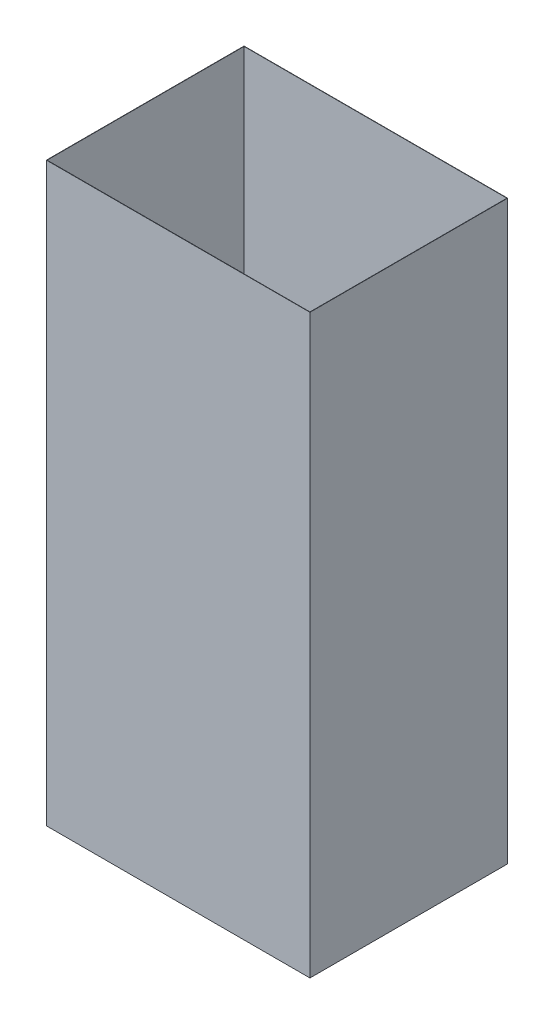
ISO-10303-21;
HEADER;
FILE_DESCRIPTION(('STEP AP214'),'2;1');
FILE_NAME('part.step','',(''),(''),'','','');
FILE_SCHEMA(('AUTOMOTIVE_DESIGN { 1 0 10303 214 1 1 1 1 }'));
ENDSEC;
DATA;
#1=APPLICATION_CONTEXT('core data for automotive mechanical design processes');
#2=APPLICATION_PROTOCOL_DEFINITION('international standard','automotive_design',2000,#1);
#3=PRODUCT_CONTEXT('',#1,'mechanical');
#4=PRODUCT('Part','Part','',(#3));
#5=PRODUCT_RELATED_PRODUCT_CATEGORY('part','',(#4));
#6=PRODUCT_DEFINITION_FORMATION('','',#4);
#7=PRODUCT_DEFINITION_CONTEXT('part definition',#1,'design');
#8=PRODUCT_DEFINITION('design','',#6,#7);
#9=PRODUCT_DEFINITION_SHAPE('','',#8);
#10=(LENGTH_UNIT() NAMED_UNIT(*) SI_UNIT(.MILLI.,.METRE.));
#11=(NAMED_UNIT(*) PLANE_ANGLE_UNIT() SI_UNIT($,.RADIAN.));
#12=(NAMED_UNIT(*) SI_UNIT($,.STERADIAN.) SOLID_ANGLE_UNIT());
#13=UNCERTAINTY_MEASURE_WITH_UNIT(LENGTH_MEASURE(1.E-05),#10,'distance_accuracy_value','');
#14=(GEOMETRIC_REPRESENTATION_CONTEXT(3) GLOBAL_UNCERTAINTY_ASSIGNED_CONTEXT((#13)) GLOBAL_UNIT_ASSIGNED_CONTEXT((#10,
#11,#12)) REPRESENTATION_CONTEXT('',''));
#15=CARTESIAN_POINT('',(0.,0.,0.));
#16=DIRECTION('',(0.,0.,1.));
#17=DIRECTION('',(1.,0.,0.));
#18=AXIS2_PLACEMENT_3D('',#15,#16,#17);
#19=CARTESIAN_POINT('',(203.2,889.,-152.4));
#20=DIRECTION('',(-1.,0.,0.));
#21=DIRECTION('',(0.,0.,1.));
#22=AXIS2_PLACEMENT_3D('',#19,#20,#21);
#23=PLANE('',#22);
#24=DIRECTION('',(0.,0.,-1.));
#25=VECTOR('',#24,1.);
#26=CARTESIAN_POINT('',(203.2,0.,-152.4));
#27=LINE('',#26,#25);
#28=CARTESIAN_POINT('',(203.2,0.,152.4));
#29=VERTEX_POINT('',#28);
#30=CARTESIAN_POINT('',(203.2,0.,-152.4));
#31=VERTEX_POINT('',#30);
#32=EDGE_CURVE('E173',#29,#31,#27,.T.);
#33=ORIENTED_EDGE('',*,*,#32,.T.);
#34=DIRECTION('',(0.,-1.,0.));
#35=VECTOR('',#34,1.);
#36=CARTESIAN_POINT('',(203.2,889.,-152.4));
#37=LINE('',#36,#35);
#38=CARTESIAN_POINT('',(203.2,889.,-152.4));
#39=VERTEX_POINT('',#38);
#40=EDGE_CURVE('E11',#39,#31,#37,.T.);
#41=ORIENTED_EDGE('',*,*,#40,.F.);
#42=DIRECTION('',(0.,0.,-1.));
#43=VECTOR('',#42,1.);
#44=CARTESIAN_POINT('',(203.2,889.,-152.4));
#45=LINE('',#44,#43);
#46=CARTESIAN_POINT('',(203.2,889.,152.4));
#47=VERTEX_POINT('',#46);
#48=EDGE_CURVE('E162',#47,#39,#45,.T.);
#49=ORIENTED_EDGE('',*,*,#48,.F.);
#50=DIRECTION('',(0.,-1.,0.));
#51=VECTOR('',#50,1.);
#52=CARTESIAN_POINT('',(203.2,889.,152.4));
#53=LINE('',#52,#51);
#54=EDGE_CURVE('E172',#47,#29,#53,.T.);
#55=ORIENTED_EDGE('',*,*,#54,.T.);
#56=EDGE_LOOP('',(#33,#41,#49,#55));
#57=FACE_BOUND('',#56,.T.);
#58=ADVANCED_FACE('F45',(#57),#23,.F.);
#59=CARTESIAN_POINT('',(-203.2,889.,-152.4));
#60=DIRECTION('',(0.,0.,1.));
#61=DIRECTION('',(1.,0.,0.));
#62=AXIS2_PLACEMENT_3D('',#59,#60,#61);
#63=PLANE('',#62);
#64=DIRECTION('',(-1.,0.,0.));
#65=VECTOR('',#64,1.);
#66=CARTESIAN_POINT('',(-203.2,0.,-152.4));
#67=LINE('',#66,#65);
#68=CARTESIAN_POINT('',(-203.2,0.,-152.4));
#69=VERTEX_POINT('',#68);
#70=EDGE_CURVE('E177',#31,#69,#67,.T.);
#71=ORIENTED_EDGE('',*,*,#70,.T.);
#72=DIRECTION('',(0.,-1.,0.));
#73=VECTOR('',#72,1.);
#74=CARTESIAN_POINT('',(-203.2,889.,-152.4));
#75=LINE('',#74,#73);
#76=CARTESIAN_POINT('',(-203.2,889.,-152.4));
#77=VERTEX_POINT('',#76);
#78=EDGE_CURVE('E53',#77,#69,#75,.T.);
#79=ORIENTED_EDGE('',*,*,#78,.F.);
#80=DIRECTION('',(-1.,0.,0.));
#81=VECTOR('',#80,1.);
#82=CARTESIAN_POINT('',(-203.2,889.,-152.4));
#83=LINE('',#82,#81);
#84=EDGE_CURVE('E97',#39,#77,#83,.T.);
#85=ORIENTED_EDGE('',*,*,#84,.F.);
#86=ORIENTED_EDGE('',*,*,#40,.T.);
#87=EDGE_LOOP('',(#71,#79,#85,#86));
#88=FACE_BOUND('',#87,.T.);
#89=ADVANCED_FACE('F212',(#88),#63,.F.);
#90=CARTESIAN_POINT('',(-203.2,889.,-152.4));
#91=DIRECTION('',(1.,0.,0.));
#92=DIRECTION('',(0.,0.,-1.));
#93=AXIS2_PLACEMENT_3D('',#90,#91,#92);
#94=PLANE('',#93);
#95=DIRECTION('',(0.,0.,1.));
#96=VECTOR('',#95,1.);
#97=CARTESIAN_POINT('',(-203.2,0.,-152.4));
#98=LINE('',#97,#96);
#99=CARTESIAN_POINT('',(-203.2,0.,152.4));
#100=VERTEX_POINT('',#99);
#101=EDGE_CURVE('E180',#69,#100,#98,.T.);
#102=ORIENTED_EDGE('',*,*,#101,.T.);
#103=DIRECTION('',(0.,-1.,0.));
#104=VECTOR('',#103,1.);
#105=CARTESIAN_POINT('',(-203.2,889.,152.4));
#106=LINE('',#105,#104);
#107=CARTESIAN_POINT('',(-203.2,889.,152.4));
#108=VERTEX_POINT('',#107);
#109=EDGE_CURVE('E187',#108,#100,#106,.T.);
#110=ORIENTED_EDGE('',*,*,#109,.F.);
#111=DIRECTION('',(0.,0.,1.));
#112=VECTOR('',#111,1.);
#113=CARTESIAN_POINT('',(-203.2,889.,-152.4));
#114=LINE('',#113,#112);
#115=EDGE_CURVE('E167',#77,#108,#114,.T.);
#116=ORIENTED_EDGE('',*,*,#115,.F.);
#117=ORIENTED_EDGE('',*,*,#78,.T.);
#118=EDGE_LOOP('',(#102,#110,#116,#117));
#119=FACE_BOUND('',#118,.T.);
#120=ADVANCED_FACE('F194',(#119),#94,.F.);
#121=CARTESIAN_POINT('',(-203.2,889.,152.4));
#122=DIRECTION('',(0.,0.,-1.));
#123=DIRECTION('',(-1.,0.,0.));
#124=AXIS2_PLACEMENT_3D('',#121,#122,#123);
#125=PLANE('',#124);
#126=DIRECTION('',(1.,0.,0.));
#127=VECTOR('',#126,1.);
#128=CARTESIAN_POINT('',(-203.2,0.,152.4));
#129=LINE('',#128,#127);
#130=EDGE_CURVE('E90',#100,#29,#129,.T.);
#131=ORIENTED_EDGE('',*,*,#130,.T.);
#132=ORIENTED_EDGE('',*,*,#54,.F.);
#133=DIRECTION('',(1.,0.,0.));
#134=VECTOR('',#133,1.);
#135=CARTESIAN_POINT('',(-203.2,889.,152.4));
#136=LINE('',#135,#134);
#137=EDGE_CURVE('E69',#108,#47,#136,.T.);
#138=ORIENTED_EDGE('',*,*,#137,.F.);
#139=ORIENTED_EDGE('',*,*,#109,.T.);
#140=EDGE_LOOP('',(#131,#132,#138,#139));
#141=FACE_BOUND('',#140,.T.);
#142=ADVANCED_FACE('F202',(#141),#125,.F.);
#143=CARTESIAN_POINT('',(0.,889.,0.));
#144=DIRECTION('',(0.,1.,0.));
#145=DIRECTION('',(0.,0.,1.));
#146=AXIS2_PLACEMENT_3D('',#143,#144,#145);
#147=PLANE('',#146);
#148=DIRECTION('',(0.,0.,-1.));
#149=VECTOR('',#148,1.);
#150=CARTESIAN_POINT('',(202.692,889.,-152.4));
#151=LINE('',#150,#149);
#152=CARTESIAN_POINT('',(202.692,889.,151.892));
#153=VERTEX_POINT('',#152);
#154=CARTESIAN_POINT('',(202.692,889.,-151.892));
#155=VERTEX_POINT('',#154);
#156=EDGE_CURVE('E146',#153,#155,#151,.T.);
#157=ORIENTED_EDGE('',*,*,#156,.F.);
#158=DIRECTION('',(1.,0.,0.));
#159=VECTOR('',#158,1.);
#160=CARTESIAN_POINT('',(-203.2,889.,151.892));
#161=LINE('',#160,#159);
#162=CARTESIAN_POINT('',(-202.692,889.,151.892));
#163=VERTEX_POINT('',#162);
#164=EDGE_CURVE('E159',#163,#153,#161,.T.);
#165=ORIENTED_EDGE('',*,*,#164,.F.);
#166=DIRECTION('',(0.,0.,1.));
#167=VECTOR('',#166,1.);
#168=CARTESIAN_POINT('',(-202.692,889.,-152.4));
#169=LINE('',#168,#167);
#170=CARTESIAN_POINT('',(-202.692,889.,-151.892));
#171=VERTEX_POINT('',#170);
#172=EDGE_CURVE('E156',#171,#163,#169,.T.);
#173=ORIENTED_EDGE('',*,*,#172,.F.);
#174=DIRECTION('',(-1.,0.,0.));
#175=VECTOR('',#174,1.);
#176=CARTESIAN_POINT('',(-203.2,889.,-151.892));
#177=LINE('',#176,#175);
#178=EDGE_CURVE('E135',#155,#171,#177,.T.);
#179=ORIENTED_EDGE('',*,*,#178,.F.);
#180=EDGE_LOOP('',(#157,#165,#173,#179));
#181=FACE_BOUND('',#180,.T.);
#182=ORIENTED_EDGE('',*,*,#48,.T.);
#183=ORIENTED_EDGE('',*,*,#84,.T.);
#184=ORIENTED_EDGE('',*,*,#115,.T.);
#185=ORIENTED_EDGE('',*,*,#137,.T.);
#186=EDGE_LOOP('',(#182,#183,#184,#185));
#187=FACE_BOUND('',#186,.T.);
#188=ADVANCED_FACE('F204',(#181,#187),#147,.T.);
#189=CARTESIAN_POINT('',(0.,0.,0.));
#190=DIRECTION('',(0.,1.,0.));
#191=DIRECTION('',(0.,0.,1.));
#192=AXIS2_PLACEMENT_3D('',#189,#190,#191);
#193=PLANE('',#192);
#194=ORIENTED_EDGE('',*,*,#32,.F.);
#195=ORIENTED_EDGE('',*,*,#130,.F.);
#196=ORIENTED_EDGE('',*,*,#101,.F.);
#197=ORIENTED_EDGE('',*,*,#70,.F.);
#198=EDGE_LOOP('',(#194,#195,#196,#197));
#199=FACE_BOUND('',#198,.T.);
#200=ADVANCED_FACE('F198',(#199),#193,.F.);
#201=CARTESIAN_POINT('',(202.692,889.,-152.4));
#202=DIRECTION('',(-1.,0.,0.));
#203=DIRECTION('',(0.,0.,1.));
#204=AXIS2_PLACEMENT_3D('',#201,#202,#203);
#205=PLANE('',#204);
#206=DIRECTION('',(0.,0.,-1.));
#207=VECTOR('',#206,1.);
#208=CARTESIAN_POINT('',(202.692,0.507999999999953,-152.4));
#209=LINE('',#208,#207);
#210=CARTESIAN_POINT('',(202.692,0.508,151.892));
#211=VERTEX_POINT('',#210);
#212=CARTESIAN_POINT('',(202.692,0.508,-151.892));
#213=VERTEX_POINT('',#212);
#214=EDGE_CURVE('E125',#211,#213,#209,.T.);
#215=ORIENTED_EDGE('',*,*,#214,.F.);
#216=DIRECTION('',(0.,-1.,0.));
#217=VECTOR('',#216,1.);
#218=CARTESIAN_POINT('',(202.692,889.,151.892));
#219=LINE('',#218,#217);
#220=EDGE_CURVE('E150',#153,#211,#219,.T.);
#221=ORIENTED_EDGE('',*,*,#220,.F.);
#222=ORIENTED_EDGE('',*,*,#156,.T.);
#223=DIRECTION('',(0.,-1.,0.));
#224=VECTOR('',#223,1.);
#225=CARTESIAN_POINT('',(202.692,889.,-151.892));
#226=LINE('',#225,#224);
#227=EDGE_CURVE('E139',#155,#213,#226,.T.);
#228=ORIENTED_EDGE('',*,*,#227,.T.);
#229=EDGE_LOOP('',(#215,#221,#222,#228));
#230=FACE_BOUND('',#229,.T.);
#231=ADVANCED_FACE('F245',(#230),#205,.T.);
#232=CARTESIAN_POINT('',(-203.2,889.,-151.892));
#233=DIRECTION('',(0.,0.,1.));
#234=DIRECTION('',(1.,0.,0.));
#235=AXIS2_PLACEMENT_3D('',#232,#233,#234);
#236=PLANE('',#235);
#237=DIRECTION('',(-1.,0.,0.));
#238=VECTOR('',#237,1.);
#239=CARTESIAN_POINT('',(-203.2,0.507999999999953,-151.892));
#240=LINE('',#239,#238);
#241=CARTESIAN_POINT('',(-202.692,0.508,-151.892));
#242=VERTEX_POINT('',#241);
#243=EDGE_CURVE('E119',#213,#242,#240,.T.);
#244=ORIENTED_EDGE('',*,*,#243,.F.);
#245=ORIENTED_EDGE('',*,*,#227,.F.);
#246=ORIENTED_EDGE('',*,*,#178,.T.);
#247=DIRECTION('',(0.,-1.,0.));
#248=VECTOR('',#247,1.);
#249=CARTESIAN_POINT('',(-202.692,889.,-151.892));
#250=LINE('',#249,#248);
#251=EDGE_CURVE('E132',#171,#242,#250,.T.);
#252=ORIENTED_EDGE('',*,*,#251,.T.);
#253=EDGE_LOOP('',(#244,#245,#246,#252));
#254=FACE_BOUND('',#253,.T.);
#255=ADVANCED_FACE('F133',(#254),#236,.T.);
#256=CARTESIAN_POINT('',(-202.692,889.,-152.4));
#257=DIRECTION('',(1.,0.,0.));
#258=DIRECTION('',(0.,0.,-1.));
#259=AXIS2_PLACEMENT_3D('',#256,#257,#258);
#260=PLANE('',#259);
#261=DIRECTION('',(0.,0.,1.));
#262=VECTOR('',#261,1.);
#263=CARTESIAN_POINT('',(-202.692,0.507999999999953,-152.4));
#264=LINE('',#263,#262);
#265=CARTESIAN_POINT('',(-202.692,0.508,151.892));
#266=VERTEX_POINT('',#265);
#267=EDGE_CURVE('E123',#242,#266,#264,.T.);
#268=ORIENTED_EDGE('',*,*,#267,.F.);
#269=ORIENTED_EDGE('',*,*,#251,.F.);
#270=ORIENTED_EDGE('',*,*,#172,.T.);
#271=DIRECTION('',(0.,-1.,0.));
#272=VECTOR('',#271,1.);
#273=CARTESIAN_POINT('',(-202.692,889.,151.892));
#274=LINE('',#273,#272);
#275=EDGE_CURVE('E60',#163,#266,#274,.T.);
#276=ORIENTED_EDGE('',*,*,#275,.T.);
#277=EDGE_LOOP('',(#268,#269,#270,#276));
#278=FACE_BOUND('',#277,.T.);
#279=ADVANCED_FACE('F141',(#278),#260,.T.);
#280=CARTESIAN_POINT('',(-203.2,889.,151.892));
#281=DIRECTION('',(0.,0.,-1.));
#282=DIRECTION('',(-1.,0.,0.));
#283=AXIS2_PLACEMENT_3D('',#280,#281,#282);
#284=PLANE('',#283);
#285=DIRECTION('',(1.,0.,0.));
#286=VECTOR('',#285,1.);
#287=CARTESIAN_POINT('',(-203.2,0.507999999999953,151.892));
#288=LINE('',#287,#286);
#289=EDGE_CURVE('E143',#266,#211,#288,.T.);
#290=ORIENTED_EDGE('',*,*,#289,.F.);
#291=ORIENTED_EDGE('',*,*,#275,.F.);
#292=ORIENTED_EDGE('',*,*,#164,.T.);
#293=ORIENTED_EDGE('',*,*,#220,.T.);
#294=EDGE_LOOP('',(#290,#291,#292,#293));
#295=FACE_BOUND('',#294,.T.);
#296=ADVANCED_FACE('F269',(#295),#284,.T.);
#297=CARTESIAN_POINT('',(0.,0.508,0.));
#298=DIRECTION('',(0.,1.,0.));
#299=DIRECTION('',(0.,0.,1.));
#300=AXIS2_PLACEMENT_3D('',#297,#298,#299);
#301=PLANE('',#300);
#302=ORIENTED_EDGE('',*,*,#214,.T.);
#303=ORIENTED_EDGE('',*,*,#243,.T.);
#304=ORIENTED_EDGE('',*,*,#267,.T.);
#305=ORIENTED_EDGE('',*,*,#289,.T.);
#306=EDGE_LOOP('',(#302,#303,#304,#305));
#307=FACE_BOUND('',#306,.T.);
#308=ADVANCED_FACE('F121',(#307),#301,.T.);
#309=CLOSED_SHELL('',(#58,#89,#120,#142,#188,#200,#231,#255,#279,#296,#308));
#310=MANIFOLD_SOLID_BREP('B2',#309);
#311=ADVANCED_BREP_SHAPE_REPRESENTATION('',(#18,#310),#14);
#312=SHAPE_DEFINITION_REPRESENTATION(#9,#311);
ENDSEC;
END-ISO-10303-21;
